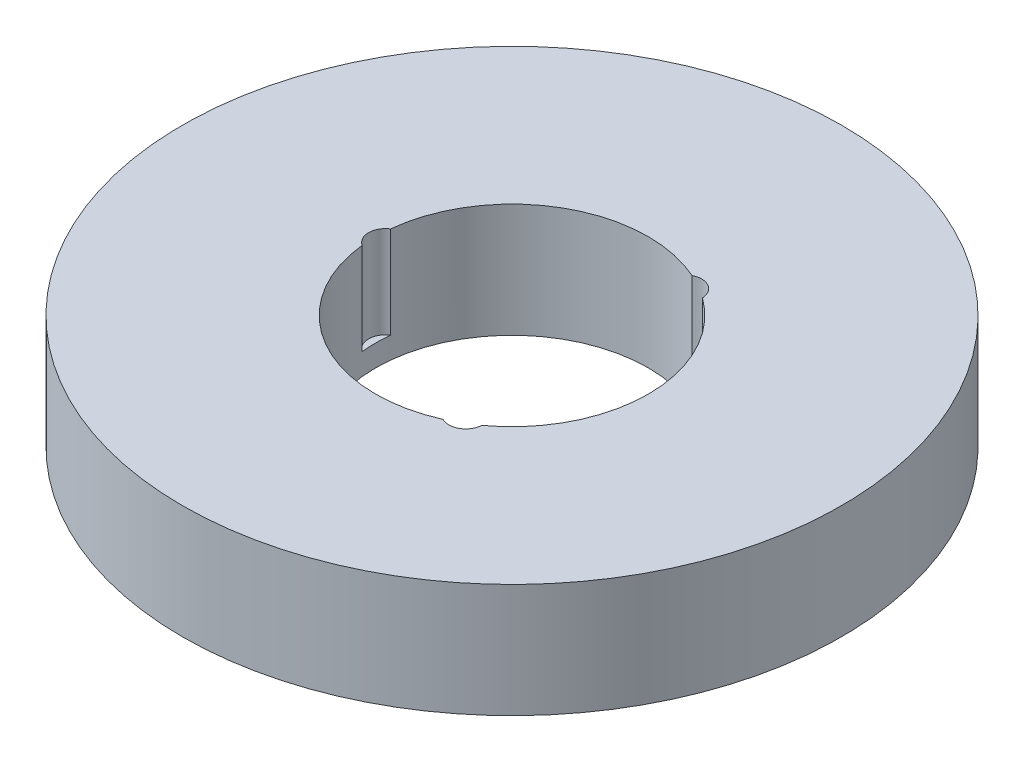
ISO-10303-21;
HEADER;
FILE_DESCRIPTION(('STEP AP214'),'2;1');
FILE_NAME('part.step','',(''),(''),'','','');
FILE_SCHEMA(('AUTOMOTIVE_DESIGN { 1 0 10303 214 1 1 1 1 }'));
ENDSEC;
DATA;
#1=APPLICATION_CONTEXT('core data for automotive mechanical design processes');
#2=APPLICATION_PROTOCOL_DEFINITION('international standard','automotive_design',2000,#1);
#3=PRODUCT_CONTEXT('',#1,'mechanical');
#4=PRODUCT('Part','Part','',(#3));
#5=PRODUCT_RELATED_PRODUCT_CATEGORY('part','',(#4));
#6=PRODUCT_DEFINITION_FORMATION('','',#4);
#7=PRODUCT_DEFINITION_CONTEXT('part definition',#1,'design');
#8=PRODUCT_DEFINITION('design','',#6,#7);
#9=PRODUCT_DEFINITION_SHAPE('','',#8);
#10=(LENGTH_UNIT() NAMED_UNIT(*) SI_UNIT(.MILLI.,.METRE.));
#11=(NAMED_UNIT(*) PLANE_ANGLE_UNIT() SI_UNIT($,.RADIAN.));
#12=(NAMED_UNIT(*) SI_UNIT($,.STERADIAN.) SOLID_ANGLE_UNIT());
#13=UNCERTAINTY_MEASURE_WITH_UNIT(LENGTH_MEASURE(1.E-05),#10,'distance_accuracy_value','');
#14=(GEOMETRIC_REPRESENTATION_CONTEXT(3) GLOBAL_UNCERTAINTY_ASSIGNED_CONTEXT((#13)) GLOBAL_UNIT_ASSIGNED_CONTEXT((#10,
#11,#12)) REPRESENTATION_CONTEXT('',''));
#15=CARTESIAN_POINT('',(0.,0.,0.));
#16=DIRECTION('',(0.,0.,1.));
#17=DIRECTION('',(1.,0.,0.));
#18=AXIS2_PLACEMENT_3D('',#15,#16,#17);
#19=CARTESIAN_POINT('',(0.,25.,0.));
#20=DIRECTION('',(0.,-1.,0.));
#21=DIRECTION('',(0.,0.,-1.));
#22=AXIS2_PLACEMENT_3D('',#19,#20,#21);
#23=CYLINDRICAL_SURFACE('',#22,72.5);
#24=CARTESIAN_POINT('',(0.,25.,0.));
#25=DIRECTION('',(0.,1.,0.));
#26=DIRECTION('',(0.,0.,1.));
#27=AXIS2_PLACEMENT_3D('',#24,#25,#26);
#28=CIRCLE('',#27,72.5);
#29=CARTESIAN_POINT('',(0.,25.,72.5));
#30=VERTEX_POINT('',#29);
#31=EDGE_CURVE('E130',#30,#30,#28,.T.);
#32=ORIENTED_EDGE('',*,*,#31,.F.);
#33=EDGE_LOOP('',(#32));
#34=FACE_BOUND('',#33,.T.);
#35=CARTESIAN_POINT('',(0.,0.,0.));
#36=DIRECTION('',(0.,1.,0.));
#37=DIRECTION('',(0.,0.,1.));
#38=AXIS2_PLACEMENT_3D('',#35,#36,#37);
#39=CIRCLE('',#38,72.5);
#40=CARTESIAN_POINT('',(0.,0.,72.5));
#41=VERTEX_POINT('',#40);
#42=EDGE_CURVE('E117',#41,#41,#39,.T.);
#43=ORIENTED_EDGE('',*,*,#42,.T.);
#44=EDGE_LOOP('',(#43));
#45=FACE_BOUND('',#44,.T.);
#46=ADVANCED_FACE('F39',(#34,#45),#23,.T.);
#47=CARTESIAN_POINT('',(0.,25.,0.));
#48=DIRECTION('',(0.,1.,0.));
#49=DIRECTION('',(0.,0.,1.));
#50=AXIS2_PLACEMENT_3D('',#47,#48,#49);
#51=PLANE('',#50);
#52=CARTESIAN_POINT('',(13.9213249854886,25.,24.112442183544));
#53=DIRECTION('',(0.,1.,0.));
#54=DIRECTION('',(0.866025403784436,0.,-0.500000000000004));
#55=AXIS2_PLACEMENT_3D('',#52,#53,#54);
#56=CIRCLE('',#55,3.69847985566345);
#57=CARTESIAN_POINT('',(12.2220825058167,25.,27.397457897057));
#58=VERTEX_POINT('',#57);
#59=CARTESIAN_POINT('',(17.6158532850578,25.,24.283362885715));
#60=VERTEX_POINT('',#59);
#61=EDGE_CURVE('E148',#58,#60,#56,.T.);
#62=ORIENTED_EDGE('',*,*,#61,.F.);
#63=CARTESIAN_POINT('',(0.,25.,0.));
#64=DIRECTION('',(0.,1.,0.));
#65=DIRECTION('',(0.,0.,1.));
#66=AXIS2_PLACEMENT_3D('',#63,#64,#65);
#67=CIRCLE('',#66,30.);
#68=CARTESIAN_POINT('',(-29.8379357908743,25.,3.11409501134198));
#69=VERTEX_POINT('',#68);
#70=EDGE_CURVE('E113',#69,#58,#67,.T.);
#71=ORIENTED_EDGE('',*,*,#70,.F.);
#72=CARTESIAN_POINT('',(-27.8426499709769,25.,0.));
#73=DIRECTION('',(0.,1.,0.));
#74=DIRECTION('',(0.,0.,1.));
#75=AXIS2_PLACEMENT_3D('',#72,#73,#74);
#76=CIRCLE('',#75,3.69847985566345);
#77=CARTESIAN_POINT('',(-29.8379357908743,25.,-3.11409501134198));
#78=VERTEX_POINT('',#77);
#79=EDGE_CURVE('E125',#78,#69,#76,.T.);
#80=ORIENTED_EDGE('',*,*,#79,.F.);
#81=CARTESIAN_POINT('',(12.2220825058163,25.,-27.3974578970571));
#82=VERTEX_POINT('',#81);
#83=EDGE_CURVE('E107',#82,#78,#67,.T.);
#84=ORIENTED_EDGE('',*,*,#83,.F.);
#85=CARTESIAN_POINT('',(13.9213249854882,25.,-24.1124421835442));
#86=DIRECTION('',(0.,1.,0.));
#87=DIRECTION('',(-0.866025403784443,0.,-0.499999999999992));
#88=AXIS2_PLACEMENT_3D('',#85,#86,#87);
#89=CIRCLE('',#88,3.69847985566345);
#90=CARTESIAN_POINT('',(17.6158532850574,25.,-24.2833628857152));
#91=VERTEX_POINT('',#90);
#92=EDGE_CURVE('E95',#91,#82,#89,.T.);
#93=ORIENTED_EDGE('',*,*,#92,.F.);
#94=EDGE_CURVE('E106',#60,#91,#67,.T.);
#95=ORIENTED_EDGE('',*,*,#94,.F.);
#96=EDGE_LOOP('',(#62,#71,#80,#84,#93,#95));
#97=FACE_BOUND('',#96,.T.);
#98=ORIENTED_EDGE('',*,*,#31,.T.);
#99=EDGE_LOOP('',(#98));
#100=FACE_BOUND('',#99,.T.);
#101=ADVANCED_FACE('F102',(#97,#100),#51,.T.);
#102=CARTESIAN_POINT('',(0.,0.,0.));
#103=DIRECTION('',(0.,1.,0.));
#104=DIRECTION('',(0.,0.,1.));
#105=AXIS2_PLACEMENT_3D('',#102,#103,#104);
#106=PLANE('',#105);
#107=CARTESIAN_POINT('',(0.,0.,0.));
#108=DIRECTION('',(0.,1.,0.));
#109=DIRECTION('',(0.,0.,1.));
#110=AXIS2_PLACEMENT_3D('',#107,#108,#109);
#111=CIRCLE('',#110,30.);
#112=CARTESIAN_POINT('',(0.,0.,30.));
#113=VERTEX_POINT('',#112);
#114=EDGE_CURVE('E118',#113,#113,#111,.T.);
#115=ORIENTED_EDGE('',*,*,#114,.T.);
#116=EDGE_LOOP('',(#115));
#117=FACE_BOUND('',#116,.T.);
#118=ORIENTED_EDGE('',*,*,#42,.F.);
#119=EDGE_LOOP('',(#118));
#120=FACE_BOUND('',#119,.T.);
#121=ADVANCED_FACE('F161',(#117,#120),#106,.F.);
#122=CARTESIAN_POINT('',(0.,25.,0.));
#123=DIRECTION('',(0.,-1.,0.));
#124=DIRECTION('',(0.,0.,-1.));
#125=AXIS2_PLACEMENT_3D('',#122,#123,#124);
#126=CYLINDRICAL_SURFACE('',#125,30.);
#127=DIRECTION('',(0.,1.,0.));
#128=VECTOR('',#127,1.);
#129=CARTESIAN_POINT('',(12.2220825058167,14.8760119647368,27.397457897057));
#130=LINE('',#129,#128);
#131=CARTESIAN_POINT('',(12.2220825058167,4.75202392947367,27.397457897057));
#132=VERTEX_POINT('',#131);
#133=EDGE_CURVE('E11',#132,#58,#130,.T.);
#134=ORIENTED_EDGE('',*,*,#133,.F.);
#135=CARTESIAN_POINT('',(0.,4.75202392947367,0.));
#136=DIRECTION('',(0.,1.,0.));
#137=DIRECTION('',(0.,0.,1.));
#138=AXIS2_PLACEMENT_3D('',#135,#136,#137);
#139=CIRCLE('',#138,30.);
#140=CARTESIAN_POINT('',(17.6158532850578,4.75202392947367,24.283362885715));
#141=VERTEX_POINT('',#140);
#142=EDGE_CURVE('E100',#132,#141,#139,.T.);
#143=ORIENTED_EDGE('',*,*,#142,.T.);
#144=DIRECTION('',(0.,1.,0.));
#145=VECTOR('',#144,1.);
#146=CARTESIAN_POINT('',(17.6158532850578,14.8760119647368,24.283362885715));
#147=LINE('',#146,#145);
#148=EDGE_CURVE('E46',#60,#141,#147,.F.);
#149=ORIENTED_EDGE('',*,*,#148,.F.);
#150=ORIENTED_EDGE('',*,*,#94,.T.);
#151=DIRECTION('',(0.,1.,0.));
#152=VECTOR('',#151,1.);
#153=CARTESIAN_POINT('',(17.6158532850574,14.8760119647368,-24.2833628857152));
#154=LINE('',#153,#152);
#155=CARTESIAN_POINT('',(17.6158532850574,4.75202392947367,-24.2833628857152));
#156=VERTEX_POINT('',#155);
#157=EDGE_CURVE('E90',#156,#91,#154,.T.);
#158=ORIENTED_EDGE('',*,*,#157,.F.);
#159=CARTESIAN_POINT('',(0.,4.75202392947367,0.));
#160=DIRECTION('',(0.,1.,0.));
#161=DIRECTION('',(0.,0.,1.));
#162=AXIS2_PLACEMENT_3D('',#159,#160,#161);
#163=CIRCLE('',#162,30.);
#164=CARTESIAN_POINT('',(12.2220825058163,4.75202392947367,-27.3974578970571));
#165=VERTEX_POINT('',#164);
#166=EDGE_CURVE('E143',#156,#165,#163,.T.);
#167=ORIENTED_EDGE('',*,*,#166,.T.);
#168=DIRECTION('',(0.,1.,0.));
#169=VECTOR('',#168,1.);
#170=CARTESIAN_POINT('',(12.2220825058163,14.8760119647368,-27.3974578970571));
#171=LINE('',#170,#169);
#172=EDGE_CURVE('E98',#82,#165,#171,.F.);
#173=ORIENTED_EDGE('',*,*,#172,.F.);
#174=ORIENTED_EDGE('',*,*,#83,.T.);
#175=DIRECTION('',(0.,1.,0.));
#176=VECTOR('',#175,1.);
#177=CARTESIAN_POINT('',(-29.8379357908743,14.8760119647368,-3.11409501134197));
#178=LINE('',#177,#176);
#179=CARTESIAN_POINT('',(-29.8379357908743,4.75202392947367,-3.11409501134198));
#180=VERTEX_POINT('',#179);
#181=EDGE_CURVE('E137',#180,#78,#178,.T.);
#182=ORIENTED_EDGE('',*,*,#181,.F.);
#183=CARTESIAN_POINT('',(0.,4.75202392947367,0.));
#184=DIRECTION('',(0.,1.,0.));
#185=DIRECTION('',(0.,0.,1.));
#186=AXIS2_PLACEMENT_3D('',#183,#184,#185);
#187=CIRCLE('',#186,30.);
#188=CARTESIAN_POINT('',(-29.8379357908743,4.75202392947367,3.11409501134198));
#189=VERTEX_POINT('',#188);
#190=EDGE_CURVE('E128',#180,#189,#187,.T.);
#191=ORIENTED_EDGE('',*,*,#190,.T.);
#192=DIRECTION('',(0.,1.,0.));
#193=VECTOR('',#192,1.);
#194=CARTESIAN_POINT('',(-29.8379357908743,14.8760119647368,3.11409501134197));
#195=LINE('',#194,#193);
#196=EDGE_CURVE('E134',#69,#189,#195,.F.);
#197=ORIENTED_EDGE('',*,*,#196,.F.);
#198=ORIENTED_EDGE('',*,*,#70,.T.);
#199=EDGE_LOOP('',(#134,#143,#149,#150,#158,#167,#173,#174,#182,#191,#197,#198));
#200=FACE_BOUND('',#199,.T.);
#201=ORIENTED_EDGE('',*,*,#114,.F.);
#202=EDGE_LOOP('',(#201));
#203=FACE_BOUND('',#202,.T.);
#204=ADVANCED_FACE('F115',(#200,#203),#126,.F.);
#205=CARTESIAN_POINT('',(-27.8426499709769,4.75202392947367,0.));
#206=DIRECTION('',(0.,1.,0.));
#207=DIRECTION('',(0.,0.,1.));
#208=AXIS2_PLACEMENT_3D('',#205,#206,#207);
#209=CYLINDRICAL_SURFACE('',#208,3.69847985566345);
#210=ORIENTED_EDGE('',*,*,#181,.T.);
#211=ORIENTED_EDGE('',*,*,#79,.T.);
#212=ORIENTED_EDGE('',*,*,#196,.T.);
#213=CARTESIAN_POINT('',(-27.8426499709769,4.75202392947367,0.));
#214=DIRECTION('',(0.,1.,0.));
#215=DIRECTION('',(0.,0.,1.));
#216=AXIS2_PLACEMENT_3D('',#213,#214,#215);
#217=CIRCLE('',#216,3.69847985566345);
#218=EDGE_CURVE('E127',#180,#189,#217,.T.);
#219=ORIENTED_EDGE('',*,*,#218,.F.);
#220=EDGE_LOOP('',(#210,#211,#212,#219));
#221=FACE_BOUND('',#220,.T.);
#222=ADVANCED_FACE('F175',(#221),#209,.F.);
#223=CARTESIAN_POINT('',(-27.8426499709769,4.75202392947367,0.));
#224=DIRECTION('',(0.,1.,0.));
#225=DIRECTION('',(0.,0.,1.));
#226=AXIS2_PLACEMENT_3D('',#223,#224,#225);
#227=PLANE('',#226);
#228=ORIENTED_EDGE('',*,*,#218,.T.);
#229=ORIENTED_EDGE('',*,*,#190,.F.);
#230=EDGE_LOOP('',(#228,#229));
#231=FACE_BOUND('',#230,.T.);
#232=ADVANCED_FACE('F176',(#231),#227,.T.);
#233=CARTESIAN_POINT('',(13.9213249854882,4.75202392947367,-24.1124421835442));
#234=DIRECTION('',(0.,1.,0.));
#235=DIRECTION('',(0.,0.,1.));
#236=AXIS2_PLACEMENT_3D('',#233,#234,#235);
#237=CYLINDRICAL_SURFACE('',#236,3.69847985566345);
#238=ORIENTED_EDGE('',*,*,#157,.T.);
#239=ORIENTED_EDGE('',*,*,#92,.T.);
#240=ORIENTED_EDGE('',*,*,#172,.T.);
#241=CARTESIAN_POINT('',(13.9213249854882,4.75202392947367,-24.1124421835442));
#242=DIRECTION('',(0.,1.,0.));
#243=DIRECTION('',(-0.866025403784443,0.,-0.499999999999992));
#244=AXIS2_PLACEMENT_3D('',#241,#242,#243);
#245=CIRCLE('',#244,3.69847985566345);
#246=EDGE_CURVE('E56',#156,#165,#245,.T.);
#247=ORIENTED_EDGE('',*,*,#246,.F.);
#248=EDGE_LOOP('',(#238,#239,#240,#247));
#249=FACE_BOUND('',#248,.T.);
#250=ADVANCED_FACE('F93',(#249),#237,.F.);
#251=CARTESIAN_POINT('',(13.9213249854882,4.75202392947367,-24.1124421835442));
#252=DIRECTION('',(0.,1.,0.));
#253=DIRECTION('',(-0.866025403784443,0.,-0.499999999999992));
#254=AXIS2_PLACEMENT_3D('',#251,#252,#253);
#255=PLANE('',#254);
#256=ORIENTED_EDGE('',*,*,#246,.T.);
#257=ORIENTED_EDGE('',*,*,#166,.F.);
#258=EDGE_LOOP('',(#256,#257));
#259=FACE_BOUND('',#258,.T.);
#260=ADVANCED_FACE('F153',(#259),#255,.T.);
#261=CARTESIAN_POINT('',(13.9213249854886,4.75202392947367,24.112442183544));
#262=DIRECTION('',(0.,1.,0.));
#263=DIRECTION('',(0.,0.,1.));
#264=AXIS2_PLACEMENT_3D('',#261,#262,#263);
#265=CYLINDRICAL_SURFACE('',#264,3.69847985566345);
#266=ORIENTED_EDGE('',*,*,#133,.T.);
#267=ORIENTED_EDGE('',*,*,#61,.T.);
#268=ORIENTED_EDGE('',*,*,#148,.T.);
#269=CARTESIAN_POINT('',(13.9213249854886,4.75202392947367,24.112442183544));
#270=DIRECTION('',(0.,1.,0.));
#271=DIRECTION('',(0.866025403784436,0.,-0.500000000000004));
#272=AXIS2_PLACEMENT_3D('',#269,#270,#271);
#273=CIRCLE('',#272,3.69847985566345);
#274=EDGE_CURVE('E55',#132,#141,#273,.T.);
#275=ORIENTED_EDGE('',*,*,#274,.F.);
#276=EDGE_LOOP('',(#266,#267,#268,#275));
#277=FACE_BOUND('',#276,.T.);
#278=ADVANCED_FACE('F144',(#277),#265,.F.);
#279=CARTESIAN_POINT('',(13.9213249854886,4.75202392947367,24.112442183544));
#280=DIRECTION('',(0.,1.,0.));
#281=DIRECTION('',(0.866025403784436,0.,-0.500000000000004));
#282=AXIS2_PLACEMENT_3D('',#279,#280,#281);
#283=PLANE('',#282);
#284=ORIENTED_EDGE('',*,*,#274,.T.);
#285=ORIENTED_EDGE('',*,*,#142,.F.);
#286=EDGE_LOOP('',(#284,#285));
#287=FACE_BOUND('',#286,.T.);
#288=ADVANCED_FACE('F150',(#287),#283,.T.);
#289=CLOSED_SHELL('',(#46,#101,#121,#204,#222,#232,#250,#260,#278,#288));
#290=MANIFOLD_SOLID_BREP('B2',#289);
#291=ADVANCED_BREP_SHAPE_REPRESENTATION('',(#18,#290),#14);
#292=SHAPE_DEFINITION_REPRESENTATION(#9,#291);
ENDSEC;
END-ISO-10303-21;
